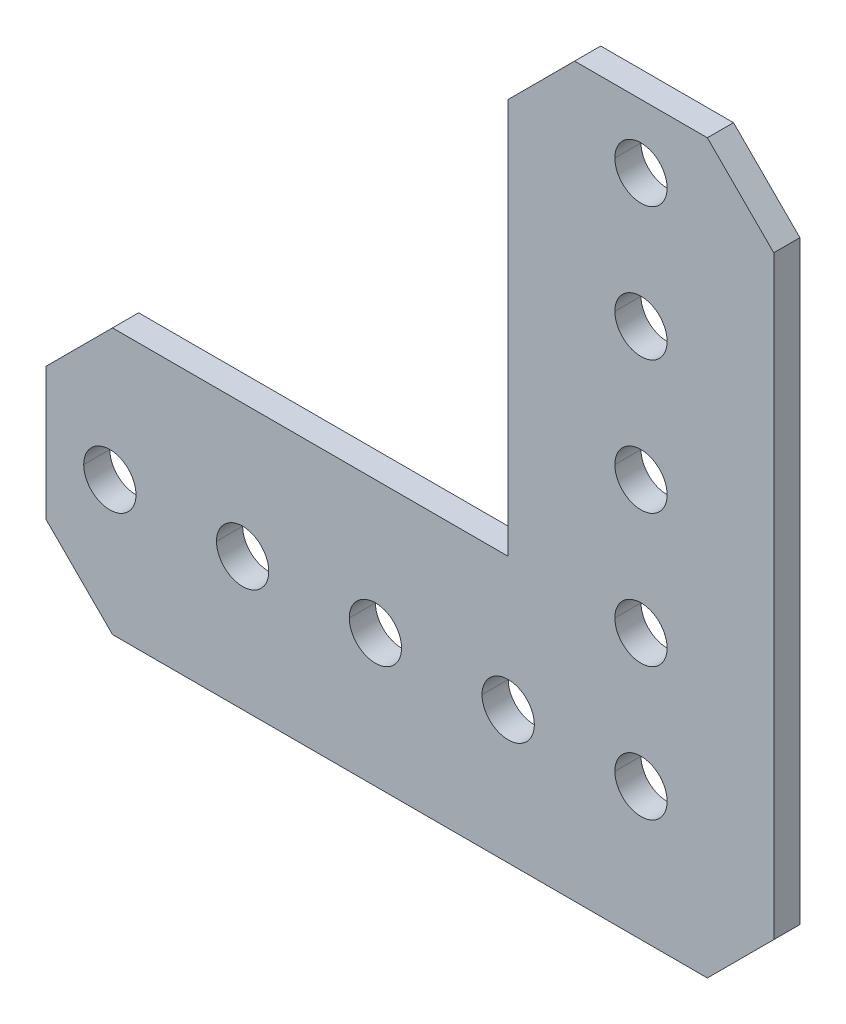
ISO-10303-21;
HEADER;
FILE_DESCRIPTION(('STEP AP214'),'2;1');
FILE_NAME('part.step','',(''),(''),'','','');
FILE_SCHEMA(('AUTOMOTIVE_DESIGN { 1 0 10303 214 1 1 1 1 }'));
ENDSEC;
DATA;
#1=APPLICATION_CONTEXT('core data for automotive mechanical design processes');
#2=APPLICATION_PROTOCOL_DEFINITION('international standard','automotive_design',2000,#1);
#3=PRODUCT_CONTEXT('',#1,'mechanical');
#4=PRODUCT('Part','Part','',(#3));
#5=PRODUCT_RELATED_PRODUCT_CATEGORY('part','',(#4));
#6=PRODUCT_DEFINITION_FORMATION('','',#4);
#7=PRODUCT_DEFINITION_CONTEXT('part definition',#1,'design');
#8=PRODUCT_DEFINITION('design','',#6,#7);
#9=PRODUCT_DEFINITION_SHAPE('','',#8);
#10=(LENGTH_UNIT() NAMED_UNIT(*) SI_UNIT(.MILLI.,.METRE.));
#11=(NAMED_UNIT(*) PLANE_ANGLE_UNIT() SI_UNIT($,.RADIAN.));
#12=(NAMED_UNIT(*) SI_UNIT($,.STERADIAN.) SOLID_ANGLE_UNIT());
#13=UNCERTAINTY_MEASURE_WITH_UNIT(LENGTH_MEASURE(1.E-05),#10,'distance_accuracy_value','');
#14=(GEOMETRIC_REPRESENTATION_CONTEXT(3) GLOBAL_UNCERTAINTY_ASSIGNED_CONTEXT((#13)) GLOBAL_UNIT_ASSIGNED_CONTEXT((#10,
#11,#12)) REPRESENTATION_CONTEXT('',''));
#15=CARTESIAN_POINT('',(0.,0.,0.));
#16=DIRECTION('',(0.,0.,1.));
#17=DIRECTION('',(1.,0.,0.));
#18=AXIS2_PLACEMENT_3D('',#15,#16,#17);
#19=CARTESIAN_POINT('',(6.34999999999982,56.896,1.25));
#20=DIRECTION('',(0.707106781186548,0.707106781186548,0.));
#21=DIRECTION('',(0.,0.,-1.));
#22=AXIS2_PLACEMENT_3D('',#19,#20,#21);
#23=PLANE('',#22);
#24=DIRECTION('',(-0.707106781186548,0.707106781186548,0.));
#25=VECTOR('',#24,1.);
#26=CARTESIAN_POINT('',(31.623,31.623,1.25));
#27=LINE('',#26,#25);
#28=CARTESIAN_POINT('',(12.6999999999998,50.546,1.25));
#29=VERTEX_POINT('',#28);
#30=CARTESIAN_POINT('',(6.34999999999981,56.896,1.25));
#31=VERTEX_POINT('',#30);
#32=EDGE_CURVE('E456',#29,#31,#27,.T.);
#33=ORIENTED_EDGE('',*,*,#32,.F.);
#34=DIRECTION('',(0.,0.,1.));
#35=VECTOR('',#34,1.);
#36=CARTESIAN_POINT('',(12.6999999999998,50.546,1.25));
#37=LINE('',#36,#35);
#38=CARTESIAN_POINT('',(12.6999999999998,50.546,-1.25));
#39=VERTEX_POINT('',#38);
#40=EDGE_CURVE('E446',#39,#29,#37,.T.);
#41=ORIENTED_EDGE('',*,*,#40,.F.);
#42=DIRECTION('',(0.707106781186548,-0.707106781186548,0.));
#43=VECTOR('',#42,1.);
#44=CARTESIAN_POINT('',(6.34999999999982,56.896,-1.25));
#45=LINE('',#44,#43);
#46=CARTESIAN_POINT('',(6.34999999999981,56.896,-1.25));
#47=VERTEX_POINT('',#46);
#48=EDGE_CURVE('E287',#47,#39,#45,.T.);
#49=ORIENTED_EDGE('',*,*,#48,.F.);
#50=DIRECTION('',(0.,0.,-1.));
#51=VECTOR('',#50,1.);
#52=CARTESIAN_POINT('',(6.34999999999981,56.896,-1.25));
#53=LINE('',#52,#51);
#54=EDGE_CURVE('E388',#31,#47,#53,.T.);
#55=ORIENTED_EDGE('',*,*,#54,.F.);
#56=EDGE_LOOP('',(#33,#41,#49,#55));
#57=FACE_BOUND('',#56,.T.);
#58=ADVANCED_FACE('F16',(#57),#23,.T.);
#59=CARTESIAN_POINT('',(-12.7000000000002,50.546,1.25));
#60=DIRECTION('',(0.707106781186548,-0.707106781186548,0.));
#61=DIRECTION('',(0.,0.,-1.));
#62=AXIS2_PLACEMENT_3D('',#59,#60,#61);
#63=PLANE('',#62);
#64=DIRECTION('',(-0.707106781186548,-0.707106781186548,0.));
#65=VECTOR('',#64,1.);
#66=CARTESIAN_POINT('',(-31.623,31.623,1.25));
#67=LINE('',#66,#65);
#68=CARTESIAN_POINT('',(-6.35000000000021,56.896,1.25));
#69=VERTEX_POINT('',#68);
#70=CARTESIAN_POINT('',(-12.7000000000002,50.546,1.25));
#71=VERTEX_POINT('',#70);
#72=EDGE_CURVE('E459',#69,#71,#67,.T.);
#73=ORIENTED_EDGE('',*,*,#72,.F.);
#74=DIRECTION('',(0.,0.,1.));
#75=VECTOR('',#74,1.);
#76=CARTESIAN_POINT('',(-6.35000000000021,56.896,1.25));
#77=LINE('',#76,#75);
#78=CARTESIAN_POINT('',(-6.35000000000021,56.896,-1.25));
#79=VERTEX_POINT('',#78);
#80=EDGE_CURVE('E389',#79,#69,#77,.T.);
#81=ORIENTED_EDGE('',*,*,#80,.F.);
#82=DIRECTION('',(0.707106781186548,0.707106781186548,0.));
#83=VECTOR('',#82,1.);
#84=CARTESIAN_POINT('',(-12.7000000000002,50.546,-1.25));
#85=LINE('',#84,#83);
#86=CARTESIAN_POINT('',(-12.7000000000002,50.546,-1.25));
#87=VERTEX_POINT('',#86);
#88=EDGE_CURVE('E425',#87,#79,#85,.T.);
#89=ORIENTED_EDGE('',*,*,#88,.F.);
#90=DIRECTION('',(0.,0.,-1.));
#91=VECTOR('',#90,1.);
#92=CARTESIAN_POINT('',(-12.7000000000002,50.546,1.25));
#93=LINE('',#92,#91);
#94=EDGE_CURVE('E524',#71,#87,#93,.T.);
#95=ORIENTED_EDGE('',*,*,#94,.F.);
#96=EDGE_LOOP('',(#73,#81,#89,#95));
#97=FACE_BOUND('',#96,.T.);
#98=ADVANCED_FACE('F18',(#97),#63,.F.);
#99=CARTESIAN_POINT('',(-56.896,6.35,1.25));
#100=DIRECTION('',(0.707106781186546,-0.707106781186549,0.));
#101=DIRECTION('',(0.,0.,-1.));
#102=AXIS2_PLACEMENT_3D('',#99,#100,#101);
#103=PLANE('',#102);
#104=DIRECTION('',(-0.707106781186549,-0.707106781186546,0.));
#105=VECTOR('',#104,1.);
#106=CARTESIAN_POINT('',(-31.623,31.623,1.25));
#107=LINE('',#106,#105);
#108=CARTESIAN_POINT('',(-50.546,12.7,1.25));
#109=VERTEX_POINT('',#108);
#110=CARTESIAN_POINT('',(-56.896,6.35,1.25));
#111=VERTEX_POINT('',#110);
#112=EDGE_CURVE('E38',#109,#111,#107,.T.);
#113=ORIENTED_EDGE('',*,*,#112,.F.);
#114=DIRECTION('',(0.,0.,1.));
#115=VECTOR('',#114,1.);
#116=CARTESIAN_POINT('',(-50.546,12.7,1.25));
#117=LINE('',#116,#115);
#118=CARTESIAN_POINT('',(-50.546,12.7,-1.25));
#119=VERTEX_POINT('',#118);
#120=EDGE_CURVE('E433',#119,#109,#117,.T.);
#121=ORIENTED_EDGE('',*,*,#120,.F.);
#122=DIRECTION('',(0.707106781186549,0.707106781186546,0.));
#123=VECTOR('',#122,1.);
#124=CARTESIAN_POINT('',(-56.896,6.35,-1.25));
#125=LINE('',#124,#123);
#126=CARTESIAN_POINT('',(-56.896,6.35,-1.25));
#127=VERTEX_POINT('',#126);
#128=EDGE_CURVE('E428',#127,#119,#125,.T.);
#129=ORIENTED_EDGE('',*,*,#128,.F.);
#130=DIRECTION('',(0.,0.,-1.));
#131=VECTOR('',#130,1.);
#132=CARTESIAN_POINT('',(-56.896,6.35,1.25));
#133=LINE('',#132,#131);
#134=EDGE_CURVE('E508',#111,#127,#133,.T.);
#135=ORIENTED_EDGE('',*,*,#134,.F.);
#136=EDGE_LOOP('',(#113,#121,#129,#135));
#137=FACE_BOUND('',#136,.T.);
#138=ADVANCED_FACE('F650',(#137),#103,.F.);
#139=CARTESIAN_POINT('',(-50.546,-12.7,1.25));
#140=DIRECTION('',(-0.707106781186548,-0.707106781186547,0.));
#141=DIRECTION('',(-0.707106781186547,0.707106781186548,0.));
#142=AXIS2_PLACEMENT_3D('',#139,#140,#141);
#143=PLANE('',#142);
#144=DIRECTION('',(0.707106781186547,-0.707106781186548,0.));
#145=VECTOR('',#144,1.);
#146=CARTESIAN_POINT('',(-31.623,-31.623,1.25));
#147=LINE('',#146,#145);
#148=CARTESIAN_POINT('',(-56.896,-6.35,1.25));
#149=VERTEX_POINT('',#148);
#150=CARTESIAN_POINT('',(-50.546,-12.7,1.25));
#151=VERTEX_POINT('',#150);
#152=EDGE_CURVE('E49',#149,#151,#147,.T.);
#153=ORIENTED_EDGE('',*,*,#152,.F.);
#154=DIRECTION('',(0.,0.,1.));
#155=VECTOR('',#154,1.);
#156=CARTESIAN_POINT('',(-56.896,-6.35,1.25));
#157=LINE('',#156,#155);
#158=CARTESIAN_POINT('',(-56.896,-6.35,-1.25));
#159=VERTEX_POINT('',#158);
#160=EDGE_CURVE('E569',#159,#149,#157,.T.);
#161=ORIENTED_EDGE('',*,*,#160,.F.);
#162=DIRECTION('',(-0.707106781186547,0.707106781186548,0.));
#163=VECTOR('',#162,1.);
#164=CARTESIAN_POINT('',(-50.546,-12.7,-1.25));
#165=LINE('',#164,#163);
#166=CARTESIAN_POINT('',(-50.546,-12.7,-1.25));
#167=VERTEX_POINT('',#166);
#168=EDGE_CURVE('E481',#167,#159,#165,.T.);
#169=ORIENTED_EDGE('',*,*,#168,.F.);
#170=DIRECTION('',(0.,0.,-1.));
#171=VECTOR('',#170,1.);
#172=CARTESIAN_POINT('',(-50.546,-12.7,-1.25));
#173=LINE('',#172,#171);
#174=EDGE_CURVE('E499',#151,#167,#173,.T.);
#175=ORIENTED_EDGE('',*,*,#174,.F.);
#176=EDGE_LOOP('',(#153,#161,#169,#175));
#177=FACE_BOUND('',#176,.T.);
#178=ADVANCED_FACE('F619',(#177),#143,.T.);
#179=CARTESIAN_POINT('',(0.,38.1,1.25));
#180=DIRECTION('',(0.,0.,1.));
#181=DIRECTION('',(1.,0.,0.));
#182=AXIS2_PLACEMENT_3D('',#179,#180,#181);
#183=CYLINDRICAL_SURFACE('',#182,2.5);
#184=DIRECTION('',(0.,0.,1.));
#185=VECTOR('',#184,1.);
#186=CARTESIAN_POINT('',(-2.49999999999996,38.1,1.25));
#187=LINE('',#186,#185);
#188=CARTESIAN_POINT('',(-2.49999999999996,38.1,-1.25));
#189=VERTEX_POINT('',#188);
#190=CARTESIAN_POINT('',(-2.49999999999996,38.1,1.25));
#191=VERTEX_POINT('',#190);
#192=EDGE_CURVE('E281',#189,#191,#187,.T.);
#193=ORIENTED_EDGE('',*,*,#192,.F.);
#194=CARTESIAN_POINT('',(0.,38.1,-1.25));
#195=DIRECTION('',(0.,0.,1.));
#196=DIRECTION('',(1.,0.,0.));
#197=AXIS2_PLACEMENT_3D('',#194,#195,#196);
#198=CIRCLE('',#197,2.5);
#199=CARTESIAN_POINT('',(2.50000000000004,38.1,-1.25));
#200=VERTEX_POINT('',#199);
#201=EDGE_CURVE('E275',#200,#189,#198,.T.);
#202=ORIENTED_EDGE('',*,*,#201,.F.);
#203=DIRECTION('',(0.,0.,1.));
#204=VECTOR('',#203,1.);
#205=CARTESIAN_POINT('',(2.50000000000004,38.1,1.25));
#206=LINE('',#205,#204);
#207=CARTESIAN_POINT('',(2.50000000000004,38.1,1.25));
#208=VERTEX_POINT('',#207);
#209=EDGE_CURVE('E278',#200,#208,#206,.T.);
#210=ORIENTED_EDGE('',*,*,#209,.T.);
#211=CARTESIAN_POINT('',(0.,38.1,1.25));
#212=DIRECTION('',(0.,0.,1.));
#213=DIRECTION('',(1.,0.,0.));
#214=AXIS2_PLACEMENT_3D('',#211,#212,#213);
#215=CIRCLE('',#214,2.5);
#216=EDGE_CURVE('E495',#208,#191,#215,.T.);
#217=ORIENTED_EDGE('',*,*,#216,.T.);
#218=EDGE_LOOP('',(#193,#202,#210,#217));
#219=FACE_BOUND('',#218,.T.);
#220=ADVANCED_FACE('F277',(#219),#183,.F.);
#221=CARTESIAN_POINT('',(0.,50.8,1.25));
#222=DIRECTION('',(0.,0.,1.));
#223=DIRECTION('',(1.,0.,0.));
#224=AXIS2_PLACEMENT_3D('',#221,#222,#223);
#225=CYLINDRICAL_SURFACE('',#224,2.5);
#226=DIRECTION('',(0.,0.,1.));
#227=VECTOR('',#226,1.);
#228=CARTESIAN_POINT('',(-2.5,50.8,1.25));
#229=LINE('',#228,#227);
#230=CARTESIAN_POINT('',(-2.5,50.8,-1.25));
#231=VERTEX_POINT('',#230);
#232=CARTESIAN_POINT('',(-2.5,50.8,1.25));
#233=VERTEX_POINT('',#232);
#234=EDGE_CURVE('E334',#231,#233,#229,.T.);
#235=ORIENTED_EDGE('',*,*,#234,.F.);
#236=CARTESIAN_POINT('',(0.,50.8,-1.25));
#237=DIRECTION('',(0.,0.,1.));
#238=DIRECTION('',(1.,0.,0.));
#239=AXIS2_PLACEMENT_3D('',#236,#237,#238);
#240=CIRCLE('',#239,2.5);
#241=CARTESIAN_POINT('',(2.5,50.8,-1.25));
#242=VERTEX_POINT('',#241);
#243=EDGE_CURVE('E286',#242,#231,#240,.T.);
#244=ORIENTED_EDGE('',*,*,#243,.F.);
#245=DIRECTION('',(0.,0.,1.));
#246=VECTOR('',#245,1.);
#247=CARTESIAN_POINT('',(2.5,50.8,1.25));
#248=LINE('',#247,#246);
#249=CARTESIAN_POINT('',(2.5,50.8,1.25));
#250=VERTEX_POINT('',#249);
#251=EDGE_CURVE('E349',#242,#250,#248,.T.);
#252=ORIENTED_EDGE('',*,*,#251,.T.);
#253=CARTESIAN_POINT('',(0.,50.8,1.25));
#254=DIRECTION('',(0.,0.,1.));
#255=DIRECTION('',(1.,0.,0.));
#256=AXIS2_PLACEMENT_3D('',#253,#254,#255);
#257=CIRCLE('',#256,2.5);
#258=EDGE_CURVE('E491',#250,#233,#257,.T.);
#259=ORIENTED_EDGE('',*,*,#258,.T.);
#260=EDGE_LOOP('',(#235,#244,#252,#259));
#261=FACE_BOUND('',#260,.T.);
#262=ADVANCED_FACE('F605',(#261),#225,.F.);
#263=CARTESIAN_POINT('',(-38.1,0.,1.25));
#264=DIRECTION('',(0.,0.,1.));
#265=DIRECTION('',(1.,0.,0.));
#266=AXIS2_PLACEMENT_3D('',#263,#264,#265);
#267=CYLINDRICAL_SURFACE('',#266,2.5);
#268=DIRECTION('',(0.,0.,1.));
#269=VECTOR('',#268,1.);
#270=CARTESIAN_POINT('',(-40.6,0.,1.25));
#271=LINE('',#270,#269);
#272=CARTESIAN_POINT('',(-40.6,0.,-1.25));
#273=VERTEX_POINT('',#272);
#274=CARTESIAN_POINT('',(-40.6,0.,1.25));
#275=VERTEX_POINT('',#274);
#276=EDGE_CURVE('E363',#273,#275,#271,.T.);
#277=ORIENTED_EDGE('',*,*,#276,.F.);
#278=CARTESIAN_POINT('',(-38.1,0.,-1.25));
#279=DIRECTION('',(0.,0.,1.));
#280=DIRECTION('',(1.,0.,0.));
#281=AXIS2_PLACEMENT_3D('',#278,#279,#280);
#282=CIRCLE('',#281,2.5);
#283=CARTESIAN_POINT('',(-35.6,0.,-1.25));
#284=VERTEX_POINT('',#283);
#285=EDGE_CURVE('E25',#284,#273,#282,.T.);
#286=ORIENTED_EDGE('',*,*,#285,.F.);
#287=DIRECTION('',(0.,0.,1.));
#288=VECTOR('',#287,1.);
#289=CARTESIAN_POINT('',(-35.6,0.,1.25));
#290=LINE('',#289,#288);
#291=CARTESIAN_POINT('',(-35.6,0.,1.25));
#292=VERTEX_POINT('',#291);
#293=EDGE_CURVE('E318',#284,#292,#290,.T.);
#294=ORIENTED_EDGE('',*,*,#293,.T.);
#295=CARTESIAN_POINT('',(-38.1,0.,1.25));
#296=DIRECTION('',(0.,0.,1.));
#297=DIRECTION('',(1.,0.,0.));
#298=AXIS2_PLACEMENT_3D('',#295,#296,#297);
#299=CIRCLE('',#298,2.5);
#300=EDGE_CURVE('E494',#292,#275,#299,.T.);
#301=ORIENTED_EDGE('',*,*,#300,.T.);
#302=EDGE_LOOP('',(#277,#286,#294,#301));
#303=FACE_BOUND('',#302,.T.);
#304=ADVANCED_FACE('F669',(#303),#267,.F.);
#305=CARTESIAN_POINT('',(-50.8,0.,1.25));
#306=DIRECTION('',(0.,0.,1.));
#307=DIRECTION('',(1.,0.,0.));
#308=AXIS2_PLACEMENT_3D('',#305,#306,#307);
#309=CYLINDRICAL_SURFACE('',#308,2.5);
#310=DIRECTION('',(0.,0.,1.));
#311=VECTOR('',#310,1.);
#312=CARTESIAN_POINT('',(-53.3,0.,1.25));
#313=LINE('',#312,#311);
#314=CARTESIAN_POINT('',(-53.3,0.,-1.25));
#315=VERTEX_POINT('',#314);
#316=CARTESIAN_POINT('',(-53.3,0.,1.25));
#317=VERTEX_POINT('',#316);
#318=EDGE_CURVE('E317',#315,#317,#313,.T.);
#319=ORIENTED_EDGE('',*,*,#318,.F.);
#320=CARTESIAN_POINT('',(-50.8,0.,-1.25));
#321=DIRECTION('',(0.,0.,1.));
#322=DIRECTION('',(1.,0.,0.));
#323=AXIS2_PLACEMENT_3D('',#320,#321,#322);
#324=CIRCLE('',#323,2.5);
#325=CARTESIAN_POINT('',(-48.3,0.,-1.25));
#326=VERTEX_POINT('',#325);
#327=EDGE_CURVE('E10',#326,#315,#324,.T.);
#328=ORIENTED_EDGE('',*,*,#327,.F.);
#329=DIRECTION('',(0.,0.,1.));
#330=VECTOR('',#329,1.);
#331=CARTESIAN_POINT('',(-48.3,0.,1.25));
#332=LINE('',#331,#330);
#333=CARTESIAN_POINT('',(-48.3,0.,1.25));
#334=VERTEX_POINT('',#333);
#335=EDGE_CURVE('E325',#326,#334,#332,.T.);
#336=ORIENTED_EDGE('',*,*,#335,.T.);
#337=CARTESIAN_POINT('',(-50.8,0.,1.25));
#338=DIRECTION('',(0.,0.,1.));
#339=DIRECTION('',(1.,0.,0.));
#340=AXIS2_PLACEMENT_3D('',#337,#338,#339);
#341=CIRCLE('',#340,2.5);
#342=EDGE_CURVE('E484',#334,#317,#341,.T.);
#343=ORIENTED_EDGE('',*,*,#342,.T.);
#344=EDGE_LOOP('',(#319,#328,#336,#343));
#345=FACE_BOUND('',#344,.T.);
#346=ADVANCED_FACE('F666',(#345),#309,.F.);
#347=CARTESIAN_POINT('',(0.,0.,-1.25));
#348=DIRECTION('',(0.,0.,1.));
#349=DIRECTION('',(1.,0.,0.));
#350=AXIS2_PLACEMENT_3D('',#347,#348,#349);
#351=PLANE('',#350);
#352=CARTESIAN_POINT('',(1.19131612205636E-13,12.7,-1.25));
#353=DIRECTION('',(0.,0.,1.));
#354=DIRECTION('',(1.,0.,0.));
#355=AXIS2_PLACEMENT_3D('',#352,#353,#354);
#356=CIRCLE('',#355,2.5);
#357=CARTESIAN_POINT('',(2.50000000000012,12.7,-1.25));
#358=VERTEX_POINT('',#357);
#359=CARTESIAN_POINT('',(-2.49999999999988,12.7,-1.25));
#360=VERTEX_POINT('',#359);
#361=EDGE_CURVE('E341',#358,#360,#356,.T.);
#362=ORIENTED_EDGE('',*,*,#361,.T.);
#363=CARTESIAN_POINT('',(1.19131612205636E-13,12.7,-1.25));
#364=DIRECTION('',(0.,0.,1.));
#365=DIRECTION('',(1.,0.,0.));
#366=AXIS2_PLACEMENT_3D('',#363,#364,#365);
#367=CIRCLE('',#366,2.5);
#368=EDGE_CURVE('E441',#360,#358,#367,.T.);
#369=ORIENTED_EDGE('',*,*,#368,.T.);
#370=EDGE_LOOP('',(#362,#369));
#371=FACE_BOUND('',#370,.T.);
#372=CARTESIAN_POINT('',(0.,25.4,-1.25));
#373=DIRECTION('',(0.,0.,1.));
#374=DIRECTION('',(1.,0.,0.));
#375=AXIS2_PLACEMENT_3D('',#372,#373,#374);
#376=CIRCLE('',#375,2.5);
#377=CARTESIAN_POINT('',(2.50000000000008,25.4,-1.25));
#378=VERTEX_POINT('',#377);
#379=CARTESIAN_POINT('',(-2.49999999999992,25.4,-1.25));
#380=VERTEX_POINT('',#379);
#381=EDGE_CURVE('E473',#378,#380,#376,.T.);
#382=ORIENTED_EDGE('',*,*,#381,.T.);
#383=CARTESIAN_POINT('',(0.,25.4,-1.25));
#384=DIRECTION('',(0.,0.,1.));
#385=DIRECTION('',(1.,0.,0.));
#386=AXIS2_PLACEMENT_3D('',#383,#384,#385);
#387=CIRCLE('',#386,2.5);
#388=EDGE_CURVE('E350',#380,#378,#387,.T.);
#389=ORIENTED_EDGE('',*,*,#388,.T.);
#390=EDGE_LOOP('',(#382,#389));
#391=FACE_BOUND('',#390,.T.);
#392=CARTESIAN_POINT('',(-12.7,0.,-1.25));
#393=DIRECTION('',(0.,0.,1.));
#394=DIRECTION('',(1.,0.,0.));
#395=AXIS2_PLACEMENT_3D('',#392,#393,#394);
#396=CIRCLE('',#395,2.5);
#397=CARTESIAN_POINT('',(-10.2,0.,-1.25));
#398=VERTEX_POINT('',#397);
#399=CARTESIAN_POINT('',(-15.2,0.,-1.25));
#400=VERTEX_POINT('',#399);
#401=EDGE_CURVE('E467',#398,#400,#396,.T.);
#402=ORIENTED_EDGE('',*,*,#401,.T.);
#403=CARTESIAN_POINT('',(-12.7,0.,-1.25));
#404=DIRECTION('',(0.,0.,1.));
#405=DIRECTION('',(1.,0.,0.));
#406=AXIS2_PLACEMENT_3D('',#403,#404,#405);
#407=CIRCLE('',#406,2.5);
#408=EDGE_CURVE('E311',#400,#398,#407,.T.);
#409=ORIENTED_EDGE('',*,*,#408,.T.);
#410=EDGE_LOOP('',(#402,#409));
#411=FACE_BOUND('',#410,.T.);
#412=CARTESIAN_POINT('',(-25.4,0.,-1.25));
#413=DIRECTION('',(0.,0.,1.));
#414=DIRECTION('',(1.,0.,0.));
#415=AXIS2_PLACEMENT_3D('',#412,#413,#414);
#416=CIRCLE('',#415,2.5);
#417=CARTESIAN_POINT('',(-22.9,0.,-1.25));
#418=VERTEX_POINT('',#417);
#419=CARTESIAN_POINT('',(-27.9,0.,-1.25));
#420=VERTEX_POINT('',#419);
#421=EDGE_CURVE('E466',#418,#420,#416,.T.);
#422=ORIENTED_EDGE('',*,*,#421,.T.);
#423=CARTESIAN_POINT('',(-25.4,0.,-1.25));
#424=DIRECTION('',(0.,0.,1.));
#425=DIRECTION('',(1.,0.,0.));
#426=AXIS2_PLACEMENT_3D('',#423,#424,#425);
#427=CIRCLE('',#426,2.5);
#428=EDGE_CURVE('E401',#420,#418,#427,.T.);
#429=ORIENTED_EDGE('',*,*,#428,.T.);
#430=EDGE_LOOP('',(#422,#429));
#431=FACE_BOUND('',#430,.T.);
#432=CARTESIAN_POINT('',(0.,0.,-1.25));
#433=DIRECTION('',(0.,0.,1.));
#434=DIRECTION('',(1.,0.,0.));
#435=AXIS2_PLACEMENT_3D('',#432,#433,#434);
#436=CIRCLE('',#435,2.5);
#437=CARTESIAN_POINT('',(-2.5,0.,-1.25));
#438=VERTEX_POINT('',#437);
#439=CARTESIAN_POINT('',(2.5,0.,-1.25));
#440=VERTEX_POINT('',#439);
#441=EDGE_CURVE('E393',#438,#440,#436,.T.);
#442=ORIENTED_EDGE('',*,*,#441,.T.);
#443=CARTESIAN_POINT('',(0.,0.,-1.25));
#444=DIRECTION('',(0.,0.,1.));
#445=DIRECTION('',(1.,0.,0.));
#446=AXIS2_PLACEMENT_3D('',#443,#444,#445);
#447=CIRCLE('',#446,2.5);
#448=EDGE_CURVE('E581',#440,#438,#447,.T.);
#449=ORIENTED_EDGE('',*,*,#448,.T.);
#450=EDGE_LOOP('',(#442,#449));
#451=FACE_BOUND('',#450,.T.);
#452=ORIENTED_EDGE('',*,*,#327,.T.);
#453=CARTESIAN_POINT('',(-50.8,0.,-1.25));
#454=DIRECTION('',(0.,0.,1.));
#455=DIRECTION('',(1.,0.,0.));
#456=AXIS2_PLACEMENT_3D('',#453,#454,#455);
#457=CIRCLE('',#456,2.5);
#458=EDGE_CURVE('E314',#315,#326,#457,.T.);
#459=ORIENTED_EDGE('',*,*,#458,.T.);
#460=EDGE_LOOP('',(#452,#459));
#461=FACE_BOUND('',#460,.T.);
#462=ORIENTED_EDGE('',*,*,#285,.T.);
#463=CARTESIAN_POINT('',(-38.1,0.,-1.25));
#464=DIRECTION('',(0.,0.,1.));
#465=DIRECTION('',(1.,0.,0.));
#466=AXIS2_PLACEMENT_3D('',#463,#464,#465);
#467=CIRCLE('',#466,2.5);
#468=EDGE_CURVE('E367',#273,#284,#467,.T.);
#469=ORIENTED_EDGE('',*,*,#468,.T.);
#470=EDGE_LOOP('',(#462,#469));
#471=FACE_BOUND('',#470,.T.);
#472=ORIENTED_EDGE('',*,*,#243,.T.);
#473=CARTESIAN_POINT('',(0.,50.8,-1.25));
#474=DIRECTION('',(0.,0.,1.));
#475=DIRECTION('',(1.,0.,0.));
#476=AXIS2_PLACEMENT_3D('',#473,#474,#475);
#477=CIRCLE('',#476,2.5);
#478=EDGE_CURVE('E295',#231,#242,#477,.T.);
#479=ORIENTED_EDGE('',*,*,#478,.T.);
#480=EDGE_LOOP('',(#472,#479));
#481=FACE_BOUND('',#480,.T.);
#482=ORIENTED_EDGE('',*,*,#201,.T.);
#483=CARTESIAN_POINT('',(0.,38.1,-1.25));
#484=DIRECTION('',(0.,0.,1.));
#485=DIRECTION('',(1.,0.,0.));
#486=AXIS2_PLACEMENT_3D('',#483,#484,#485);
#487=CIRCLE('',#486,2.5);
#488=EDGE_CURVE('E291',#189,#200,#487,.T.);
#489=ORIENTED_EDGE('',*,*,#488,.T.);
#490=EDGE_LOOP('',(#482,#489));
#491=FACE_BOUND('',#490,.T.);
#492=DIRECTION('',(1.,0.,0.));
#493=VECTOR('',#492,1.);
#494=CARTESIAN_POINT('',(0.,-12.7,-1.25));
#495=LINE('',#494,#493);
#496=CARTESIAN_POINT('',(6.35,-12.7,-1.25));
#497=VERTEX_POINT('',#496);
#498=EDGE_CURVE('E503',#167,#497,#495,.T.);
#499=ORIENTED_EDGE('',*,*,#498,.F.);
#500=ORIENTED_EDGE('',*,*,#168,.T.);
#501=DIRECTION('',(0.,1.,0.));
#502=VECTOR('',#501,1.);
#503=CARTESIAN_POINT('',(-56.896,0.,-1.25));
#504=LINE('',#503,#502);
#505=EDGE_CURVE('E432',#159,#127,#504,.T.);
#506=ORIENTED_EDGE('',*,*,#505,.T.);
#507=ORIENTED_EDGE('',*,*,#128,.T.);
#508=DIRECTION('',(1.,0.,0.));
#509=VECTOR('',#508,1.);
#510=CARTESIAN_POINT('',(0.,12.7,-1.25));
#511=LINE('',#510,#509);
#512=CARTESIAN_POINT('',(-12.7,12.7,-1.25));
#513=VERTEX_POINT('',#512);
#514=EDGE_CURVE('E563',#119,#513,#511,.T.);
#515=ORIENTED_EDGE('',*,*,#514,.T.);
#516=DIRECTION('',(0.,1.,0.));
#517=VECTOR('',#516,1.);
#518=CARTESIAN_POINT('',(-12.7,0.,-1.25));
#519=LINE('',#518,#517);
#520=EDGE_CURVE('E528',#513,#87,#519,.T.);
#521=ORIENTED_EDGE('',*,*,#520,.T.);
#522=ORIENTED_EDGE('',*,*,#88,.T.);
#523=DIRECTION('',(1.,0.,0.));
#524=VECTOR('',#523,1.);
#525=CARTESIAN_POINT('',(-1.55431223447522E-13,56.896,-1.25));
#526=LINE('',#525,#524);
#527=EDGE_CURVE('E543',#79,#47,#526,.T.);
#528=ORIENTED_EDGE('',*,*,#527,.T.);
#529=ORIENTED_EDGE('',*,*,#48,.T.);
#530=DIRECTION('',(0.,1.,0.));
#531=VECTOR('',#530,1.);
#532=CARTESIAN_POINT('',(12.7,0.,-1.25));
#533=LINE('',#532,#531);
#534=CARTESIAN_POINT('',(12.7,-6.35,-1.25));
#535=VERTEX_POINT('',#534);
#536=EDGE_CURVE('E442',#535,#39,#533,.T.);
#537=ORIENTED_EDGE('',*,*,#536,.F.);
#538=DIRECTION('',(0.707106781186547,0.707106781186549,0.));
#539=VECTOR('',#538,1.);
#540=CARTESIAN_POINT('',(9.525,-9.525,-1.25));
#541=LINE('',#540,#539);
#542=EDGE_CURVE('E517',#497,#535,#541,.T.);
#543=ORIENTED_EDGE('',*,*,#542,.F.);
#544=EDGE_LOOP('',(#499,#500,#506,#507,#515,#521,#522,#528,#529,#537,#543));
#545=FACE_BOUND('',#544,.T.);
#546=ADVANCED_FACE('F297',(#371,#391,#411,#431,#451,#461,#471,#481,#491,#545),#351,.F.);
#547=CARTESIAN_POINT('',(0.,0.,1.25));
#548=DIRECTION('',(0.,0.,1.));
#549=DIRECTION('',(1.,0.,0.));
#550=AXIS2_PLACEMENT_3D('',#547,#548,#549);
#551=PLANE('',#550);
#552=CARTESIAN_POINT('',(1.19131612205636E-13,12.7,1.25));
#553=DIRECTION('',(0.,0.,1.));
#554=DIRECTION('',(1.,0.,0.));
#555=AXIS2_PLACEMENT_3D('',#552,#553,#554);
#556=CIRCLE('',#555,2.5);
#557=CARTESIAN_POINT('',(2.50000000000012,12.7,1.25));
#558=VERTEX_POINT('',#557);
#559=CARTESIAN_POINT('',(-2.49999999999988,12.7,1.25));
#560=VERTEX_POINT('',#559);
#561=EDGE_CURVE('E344',#558,#560,#556,.T.);
#562=ORIENTED_EDGE('',*,*,#561,.F.);
#563=CARTESIAN_POINT('',(1.19131612205636E-13,12.7,1.25));
#564=DIRECTION('',(0.,0.,1.));
#565=DIRECTION('',(1.,0.,0.));
#566=AXIS2_PLACEMENT_3D('',#563,#564,#565);
#567=CIRCLE('',#566,2.5);
#568=EDGE_CURVE('E455',#560,#558,#567,.T.);
#569=ORIENTED_EDGE('',*,*,#568,.F.);
#570=EDGE_LOOP('',(#562,#569));
#571=FACE_BOUND('',#570,.T.);
#572=CARTESIAN_POINT('',(0.,25.4,1.25));
#573=DIRECTION('',(0.,0.,1.));
#574=DIRECTION('',(1.,0.,0.));
#575=AXIS2_PLACEMENT_3D('',#572,#573,#574);
#576=CIRCLE('',#575,2.5);
#577=CARTESIAN_POINT('',(2.50000000000008,25.4,1.25));
#578=VERTEX_POINT('',#577);
#579=CARTESIAN_POINT('',(-2.49999999999992,25.4,1.25));
#580=VERTEX_POINT('',#579);
#581=EDGE_CURVE('E476',#578,#580,#576,.T.);
#582=ORIENTED_EDGE('',*,*,#581,.F.);
#583=CARTESIAN_POINT('',(0.,25.4,1.25));
#584=DIRECTION('',(0.,0.,1.));
#585=DIRECTION('',(1.,0.,0.));
#586=AXIS2_PLACEMENT_3D('',#583,#584,#585);
#587=CIRCLE('',#586,2.5);
#588=EDGE_CURVE('E424',#580,#578,#587,.T.);
#589=ORIENTED_EDGE('',*,*,#588,.F.);
#590=EDGE_LOOP('',(#582,#589));
#591=FACE_BOUND('',#590,.T.);
#592=CARTESIAN_POINT('',(-12.7,0.,1.25));
#593=DIRECTION('',(0.,0.,1.));
#594=DIRECTION('',(1.,0.,0.));
#595=AXIS2_PLACEMENT_3D('',#592,#593,#594);
#596=CIRCLE('',#595,2.5);
#597=CARTESIAN_POINT('',(-10.2,0.,1.25));
#598=VERTEX_POINT('',#597);
#599=CARTESIAN_POINT('',(-15.2,0.,1.25));
#600=VERTEX_POINT('',#599);
#601=EDGE_CURVE('E463',#598,#600,#596,.T.);
#602=ORIENTED_EDGE('',*,*,#601,.F.);
#603=CARTESIAN_POINT('',(-12.7,0.,1.25));
#604=DIRECTION('',(0.,0.,1.));
#605=DIRECTION('',(1.,0.,0.));
#606=AXIS2_PLACEMENT_3D('',#603,#604,#605);
#607=CIRCLE('',#606,2.5);
#608=EDGE_CURVE('E310',#600,#598,#607,.T.);
#609=ORIENTED_EDGE('',*,*,#608,.F.);
#610=EDGE_LOOP('',(#602,#609));
#611=FACE_BOUND('',#610,.T.);
#612=CARTESIAN_POINT('',(-25.4,0.,1.25));
#613=DIRECTION('',(0.,0.,1.));
#614=DIRECTION('',(1.,0.,0.));
#615=AXIS2_PLACEMENT_3D('',#612,#613,#614);
#616=CIRCLE('',#615,2.5);
#617=CARTESIAN_POINT('',(-22.9,0.,1.25));
#618=VERTEX_POINT('',#617);
#619=CARTESIAN_POINT('',(-27.9,0.,1.25));
#620=VERTEX_POINT('',#619);
#621=EDGE_CURVE('E487',#618,#620,#616,.T.);
#622=ORIENTED_EDGE('',*,*,#621,.F.);
#623=CARTESIAN_POINT('',(-25.4,0.,1.25));
#624=DIRECTION('',(0.,0.,1.));
#625=DIRECTION('',(1.,0.,0.));
#626=AXIS2_PLACEMENT_3D('',#623,#624,#625);
#627=CIRCLE('',#626,2.5);
#628=EDGE_CURVE('E324',#620,#618,#627,.T.);
#629=ORIENTED_EDGE('',*,*,#628,.F.);
#630=EDGE_LOOP('',(#622,#629));
#631=FACE_BOUND('',#630,.T.);
#632=CARTESIAN_POINT('',(0.,0.,1.25));
#633=DIRECTION('',(0.,0.,1.));
#634=DIRECTION('',(1.,0.,0.));
#635=AXIS2_PLACEMENT_3D('',#632,#633,#634);
#636=CIRCLE('',#635,2.5);
#637=CARTESIAN_POINT('',(-2.5,0.,1.25));
#638=VERTEX_POINT('',#637);
#639=CARTESIAN_POINT('',(2.5,0.,1.25));
#640=VERTEX_POINT('',#639);
#641=EDGE_CURVE('E329',#638,#640,#636,.T.);
#642=ORIENTED_EDGE('',*,*,#641,.F.);
#643=CARTESIAN_POINT('',(0.,0.,1.25));
#644=DIRECTION('',(0.,0.,1.));
#645=DIRECTION('',(1.,0.,0.));
#646=AXIS2_PLACEMENT_3D('',#643,#644,#645);
#647=CIRCLE('',#646,2.5);
#648=EDGE_CURVE('E512',#640,#638,#647,.T.);
#649=ORIENTED_EDGE('',*,*,#648,.F.);
#650=EDGE_LOOP('',(#642,#649));
#651=FACE_BOUND('',#650,.T.);
#652=ORIENTED_EDGE('',*,*,#342,.F.);
#653=CARTESIAN_POINT('',(-50.8,0.,1.25));
#654=DIRECTION('',(0.,0.,1.));
#655=DIRECTION('',(1.,0.,0.));
#656=AXIS2_PLACEMENT_3D('',#653,#654,#655);
#657=CIRCLE('',#656,2.5);
#658=EDGE_CURVE('E330',#317,#334,#657,.T.);
#659=ORIENTED_EDGE('',*,*,#658,.F.);
#660=EDGE_LOOP('',(#652,#659));
#661=FACE_BOUND('',#660,.T.);
#662=ORIENTED_EDGE('',*,*,#300,.F.);
#663=CARTESIAN_POINT('',(-38.1,0.,1.25));
#664=DIRECTION('',(0.,0.,1.));
#665=DIRECTION('',(1.,0.,0.));
#666=AXIS2_PLACEMENT_3D('',#663,#664,#665);
#667=CIRCLE('',#666,2.5);
#668=EDGE_CURVE('E359',#275,#292,#667,.T.);
#669=ORIENTED_EDGE('',*,*,#668,.F.);
#670=EDGE_LOOP('',(#662,#669));
#671=FACE_BOUND('',#670,.T.);
#672=ORIENTED_EDGE('',*,*,#258,.F.);
#673=CARTESIAN_POINT('',(0.,50.8,1.25));
#674=DIRECTION('',(0.,0.,1.));
#675=DIRECTION('',(1.,0.,0.));
#676=AXIS2_PLACEMENT_3D('',#673,#674,#675);
#677=CIRCLE('',#676,2.5);
#678=EDGE_CURVE('E340',#233,#250,#677,.T.);
#679=ORIENTED_EDGE('',*,*,#678,.F.);
#680=EDGE_LOOP('',(#672,#679));
#681=FACE_BOUND('',#680,.T.);
#682=ORIENTED_EDGE('',*,*,#216,.F.);
#683=CARTESIAN_POINT('',(0.,38.1,1.25));
#684=DIRECTION('',(0.,0.,1.));
#685=DIRECTION('',(1.,0.,0.));
#686=AXIS2_PLACEMENT_3D('',#683,#684,#685);
#687=CIRCLE('',#686,2.5);
#688=EDGE_CURVE('E293',#191,#208,#687,.T.);
#689=ORIENTED_EDGE('',*,*,#688,.F.);
#690=EDGE_LOOP('',(#682,#689));
#691=FACE_BOUND('',#690,.T.);
#692=DIRECTION('',(0.,1.,0.));
#693=VECTOR('',#692,1.);
#694=CARTESIAN_POINT('',(-56.896,0.,1.25));
#695=LINE('',#694,#693);
#696=EDGE_CURVE('E513',#149,#111,#695,.T.);
#697=ORIENTED_EDGE('',*,*,#696,.F.);
#698=ORIENTED_EDGE('',*,*,#152,.T.);
#699=DIRECTION('',(1.,0.,0.));
#700=VECTOR('',#699,1.);
#701=CARTESIAN_POINT('',(0.,-12.7,1.25));
#702=LINE('',#701,#700);
#703=CARTESIAN_POINT('',(6.35,-12.7,1.25));
#704=VERTEX_POINT('',#703);
#705=EDGE_CURVE('E490',#151,#704,#702,.T.);
#706=ORIENTED_EDGE('',*,*,#705,.T.);
#707=DIRECTION('',(0.707106781186547,0.707106781186549,0.));
#708=VECTOR('',#707,1.);
#709=CARTESIAN_POINT('',(9.525,-9.525,1.25));
#710=LINE('',#709,#708);
#711=CARTESIAN_POINT('',(12.7,-6.35,1.25));
#712=VERTEX_POINT('',#711);
#713=EDGE_CURVE('E447',#704,#712,#710,.T.);
#714=ORIENTED_EDGE('',*,*,#713,.T.);
#715=DIRECTION('',(0.,1.,0.));
#716=VECTOR('',#715,1.);
#717=CARTESIAN_POINT('',(12.7,0.,1.25));
#718=LINE('',#717,#716);
#719=EDGE_CURVE('E539',#712,#29,#718,.T.);
#720=ORIENTED_EDGE('',*,*,#719,.T.);
#721=ORIENTED_EDGE('',*,*,#32,.T.);
#722=DIRECTION('',(1.,0.,0.));
#723=VECTOR('',#722,1.);
#724=CARTESIAN_POINT('',(-1.55431223447522E-13,56.896,1.25));
#725=LINE('',#724,#723);
#726=EDGE_CURVE('E384',#69,#31,#725,.T.);
#727=ORIENTED_EDGE('',*,*,#726,.F.);
#728=ORIENTED_EDGE('',*,*,#72,.T.);
#729=DIRECTION('',(0.,1.,0.));
#730=VECTOR('',#729,1.);
#731=CARTESIAN_POINT('',(-12.7,0.,1.25));
#732=LINE('',#731,#730);
#733=CARTESIAN_POINT('',(-12.7,12.7,1.25));
#734=VERTEX_POINT('',#733);
#735=EDGE_CURVE('E529',#734,#71,#732,.T.);
#736=ORIENTED_EDGE('',*,*,#735,.F.);
#737=DIRECTION('',(1.,0.,0.));
#738=VECTOR('',#737,1.);
#739=CARTESIAN_POINT('',(0.,12.7,1.25));
#740=LINE('',#739,#738);
#741=EDGE_CURVE('E429',#109,#734,#740,.T.);
#742=ORIENTED_EDGE('',*,*,#741,.F.);
#743=ORIENTED_EDGE('',*,*,#112,.T.);
#744=EDGE_LOOP('',(#697,#698,#706,#714,#720,#721,#727,#728,#736,#742,#743));
#745=FACE_BOUND('',#744,.T.);
#746=ADVANCED_FACE('F610',(#571,#591,#611,#631,#651,#661,#671,#681,#691,#745),#551,.T.);
#747=CARTESIAN_POINT('',(0.,0.,1.25));
#748=DIRECTION('',(0.,0.,-1.));
#749=DIRECTION('',(-1.,0.,0.));
#750=AXIS2_PLACEMENT_3D('',#747,#748,#749);
#751=CYLINDRICAL_SURFACE('',#750,2.5);
#752=DIRECTION('',(0.,0.,-1.));
#753=VECTOR('',#752,1.);
#754=CARTESIAN_POINT('',(2.5,0.,1.25));
#755=LINE('',#754,#753);
#756=EDGE_CURVE('E383',#640,#440,#755,.T.);
#757=ORIENTED_EDGE('',*,*,#756,.F.);
#758=ORIENTED_EDGE('',*,*,#648,.T.);
#759=DIRECTION('',(0.,0.,-1.));
#760=VECTOR('',#759,1.);
#761=CARTESIAN_POINT('',(-2.5,0.,1.25));
#762=LINE('',#761,#760);
#763=EDGE_CURVE('E397',#638,#438,#762,.T.);
#764=ORIENTED_EDGE('',*,*,#763,.T.);
#765=ORIENTED_EDGE('',*,*,#448,.F.);
#766=EDGE_LOOP('',(#757,#758,#764,#765));
#767=FACE_BOUND('',#766,.T.);
#768=ADVANCED_FACE('F613',(#767),#751,.F.);
#769=CARTESIAN_POINT('',(-56.896,0.,1.25));
#770=DIRECTION('',(-1.,0.,0.));
#771=DIRECTION('',(0.,0.,1.));
#772=AXIS2_PLACEMENT_3D('',#769,#770,#771);
#773=PLANE('',#772);
#774=ORIENTED_EDGE('',*,*,#505,.F.);
#775=ORIENTED_EDGE('',*,*,#160,.T.);
#776=ORIENTED_EDGE('',*,*,#696,.T.);
#777=ORIENTED_EDGE('',*,*,#134,.T.);
#778=EDGE_LOOP('',(#774,#775,#776,#777));
#779=FACE_BOUND('',#778,.T.);
#780=ADVANCED_FACE('F618',(#779),#773,.T.);
#781=CARTESIAN_POINT('',(0.,12.7,1.25));
#782=DIRECTION('',(0.,1.,0.));
#783=DIRECTION('',(1.,0.,0.));
#784=AXIS2_PLACEMENT_3D('',#781,#782,#783);
#785=PLANE('',#784);
#786=ORIENTED_EDGE('',*,*,#514,.F.);
#787=ORIENTED_EDGE('',*,*,#120,.T.);
#788=ORIENTED_EDGE('',*,*,#741,.T.);
#789=DIRECTION('',(0.,0.,-1.));
#790=VECTOR('',#789,1.);
#791=CARTESIAN_POINT('',(-12.7,12.7,1.25));
#792=LINE('',#791,#790);
#793=EDGE_CURVE('E559',#734,#513,#792,.T.);
#794=ORIENTED_EDGE('',*,*,#793,.T.);
#795=EDGE_LOOP('',(#786,#787,#788,#794));
#796=FACE_BOUND('',#795,.T.);
#797=ADVANCED_FACE('F648',(#796),#785,.T.);
#798=CARTESIAN_POINT('',(-12.7,0.,1.25));
#799=DIRECTION('',(-1.,0.,0.));
#800=DIRECTION('',(0.,1.,0.));
#801=AXIS2_PLACEMENT_3D('',#798,#799,#800);
#802=PLANE('',#801);
#803=ORIENTED_EDGE('',*,*,#735,.T.);
#804=ORIENTED_EDGE('',*,*,#94,.T.);
#805=ORIENTED_EDGE('',*,*,#520,.F.);
#806=ORIENTED_EDGE('',*,*,#793,.F.);
#807=EDGE_LOOP('',(#803,#804,#805,#806));
#808=FACE_BOUND('',#807,.T.);
#809=ADVANCED_FACE('F644',(#808),#802,.T.);
#810=CARTESIAN_POINT('',(-1.55431223447522E-13,56.896,1.25));
#811=DIRECTION('',(0.,1.,0.));
#812=DIRECTION('',(1.,0.,0.));
#813=AXIS2_PLACEMENT_3D('',#810,#811,#812);
#814=PLANE('',#813);
#815=ORIENTED_EDGE('',*,*,#527,.F.);
#816=ORIENTED_EDGE('',*,*,#80,.T.);
#817=ORIENTED_EDGE('',*,*,#726,.T.);
#818=ORIENTED_EDGE('',*,*,#54,.T.);
#819=EDGE_LOOP('',(#815,#816,#817,#818));
#820=FACE_BOUND('',#819,.T.);
#821=ADVANCED_FACE('F639',(#820),#814,.T.);
#822=CARTESIAN_POINT('',(12.7,0.,1.25));
#823=DIRECTION('',(-1.,0.,0.));
#824=DIRECTION('',(0.,1.,0.));
#825=AXIS2_PLACEMENT_3D('',#822,#823,#824);
#826=PLANE('',#825);
#827=ORIENTED_EDGE('',*,*,#536,.T.);
#828=ORIENTED_EDGE('',*,*,#40,.T.);
#829=ORIENTED_EDGE('',*,*,#719,.F.);
#830=DIRECTION('',(0.,0.,-1.));
#831=VECTOR('',#830,1.);
#832=CARTESIAN_POINT('',(12.7,-6.35,1.25));
#833=LINE('',#832,#831);
#834=EDGE_CURVE('E521',#712,#535,#833,.T.);
#835=ORIENTED_EDGE('',*,*,#834,.T.);
#836=EDGE_LOOP('',(#827,#828,#829,#835));
#837=FACE_BOUND('',#836,.T.);
#838=ADVANCED_FACE('F629',(#837),#826,.F.);
#839=CARTESIAN_POINT('',(9.525,-9.525,1.25));
#840=DIRECTION('',(-0.707106781186549,0.707106781186546,0.));
#841=DIRECTION('',(0.,0.,1.));
#842=AXIS2_PLACEMENT_3D('',#839,#840,#841);
#843=PLANE('',#842);
#844=ORIENTED_EDGE('',*,*,#542,.T.);
#845=ORIENTED_EDGE('',*,*,#834,.F.);
#846=ORIENTED_EDGE('',*,*,#713,.F.);
#847=DIRECTION('',(0.,0.,-1.));
#848=VECTOR('',#847,1.);
#849=CARTESIAN_POINT('',(6.35,-12.7,1.25));
#850=LINE('',#849,#848);
#851=EDGE_CURVE('E507',#704,#497,#850,.T.);
#852=ORIENTED_EDGE('',*,*,#851,.T.);
#853=EDGE_LOOP('',(#844,#845,#846,#852));
#854=FACE_BOUND('',#853,.T.);
#855=ADVANCED_FACE('F627',(#854),#843,.F.);
#856=CARTESIAN_POINT('',(0.,-12.7,1.25));
#857=DIRECTION('',(0.,1.,0.));
#858=DIRECTION('',(1.,0.,0.));
#859=AXIS2_PLACEMENT_3D('',#856,#857,#858);
#860=PLANE('',#859);
#861=ORIENTED_EDGE('',*,*,#705,.F.);
#862=ORIENTED_EDGE('',*,*,#174,.T.);
#863=ORIENTED_EDGE('',*,*,#498,.T.);
#864=ORIENTED_EDGE('',*,*,#851,.F.);
#865=EDGE_LOOP('',(#861,#862,#863,#864));
#866=FACE_BOUND('',#865,.T.);
#867=ADVANCED_FACE('F624',(#866),#860,.F.);
#868=CARTESIAN_POINT('',(-25.4,0.,1.25));
#869=DIRECTION('',(0.,0.,1.));
#870=DIRECTION('',(1.,0.,0.));
#871=AXIS2_PLACEMENT_3D('',#868,#869,#870);
#872=CYLINDRICAL_SURFACE('',#871,2.5);
#873=DIRECTION('',(0.,0.,1.));
#874=VECTOR('',#873,1.);
#875=CARTESIAN_POINT('',(-27.9,0.,1.25));
#876=LINE('',#875,#874);
#877=EDGE_CURVE('E405',#420,#620,#876,.T.);
#878=ORIENTED_EDGE('',*,*,#877,.F.);
#879=ORIENTED_EDGE('',*,*,#421,.F.);
#880=DIRECTION('',(0.,0.,1.));
#881=VECTOR('',#880,1.);
#882=CARTESIAN_POINT('',(-22.9,0.,1.25));
#883=LINE('',#882,#881);
#884=EDGE_CURVE('E320',#418,#618,#883,.T.);
#885=ORIENTED_EDGE('',*,*,#884,.T.);
#886=ORIENTED_EDGE('',*,*,#621,.T.);
#887=EDGE_LOOP('',(#878,#879,#885,#886));
#888=FACE_BOUND('',#887,.T.);
#889=ADVANCED_FACE('F696',(#888),#872,.F.);
#890=CARTESIAN_POINT('',(-12.7,0.,1.25));
#891=DIRECTION('',(0.,0.,1.));
#892=DIRECTION('',(1.,0.,0.));
#893=AXIS2_PLACEMENT_3D('',#890,#891,#892);
#894=CYLINDRICAL_SURFACE('',#893,2.5);
#895=DIRECTION('',(0.,0.,1.));
#896=VECTOR('',#895,1.);
#897=CARTESIAN_POINT('',(-15.2,0.,1.25));
#898=LINE('',#897,#896);
#899=EDGE_CURVE('E306',#400,#600,#898,.T.);
#900=ORIENTED_EDGE('',*,*,#899,.F.);
#901=ORIENTED_EDGE('',*,*,#401,.F.);
#902=DIRECTION('',(0.,0.,1.));
#903=VECTOR('',#902,1.);
#904=CARTESIAN_POINT('',(-10.2,0.,1.25));
#905=LINE('',#904,#903);
#906=EDGE_CURVE('E355',#398,#598,#905,.T.);
#907=ORIENTED_EDGE('',*,*,#906,.T.);
#908=ORIENTED_EDGE('',*,*,#601,.T.);
#909=EDGE_LOOP('',(#900,#901,#907,#908));
#910=FACE_BOUND('',#909,.T.);
#911=ADVANCED_FACE('F693',(#910),#894,.F.);
#912=CARTESIAN_POINT('',(0.,25.4,1.25));
#913=DIRECTION('',(0.,0.,1.));
#914=DIRECTION('',(1.,0.,0.));
#915=AXIS2_PLACEMENT_3D('',#912,#913,#914);
#916=CYLINDRICAL_SURFACE('',#915,2.5);
#917=DIRECTION('',(0.,0.,1.));
#918=VECTOR('',#917,1.);
#919=CARTESIAN_POINT('',(-2.49999999999992,25.4,1.25));
#920=LINE('',#919,#918);
#921=EDGE_CURVE('E354',#380,#580,#920,.T.);
#922=ORIENTED_EDGE('',*,*,#921,.F.);
#923=ORIENTED_EDGE('',*,*,#381,.F.);
#924=DIRECTION('',(0.,0.,1.));
#925=VECTOR('',#924,1.);
#926=CARTESIAN_POINT('',(2.50000000000008,25.4,1.25));
#927=LINE('',#926,#925);
#928=EDGE_CURVE('E437',#378,#578,#927,.T.);
#929=ORIENTED_EDGE('',*,*,#928,.T.);
#930=ORIENTED_EDGE('',*,*,#581,.T.);
#931=EDGE_LOOP('',(#922,#923,#929,#930));
#932=FACE_BOUND('',#931,.T.);
#933=ADVANCED_FACE('F691',(#932),#916,.F.);
#934=CARTESIAN_POINT('',(1.19131612205636E-13,12.7,1.25));
#935=DIRECTION('',(0.,0.,1.));
#936=DIRECTION('',(1.,0.,0.));
#937=AXIS2_PLACEMENT_3D('',#934,#935,#936);
#938=CYLINDRICAL_SURFACE('',#937,2.5);
#939=DIRECTION('',(0.,0.,1.));
#940=VECTOR('',#939,1.);
#941=CARTESIAN_POINT('',(-2.49999999999988,12.7,1.25));
#942=LINE('',#941,#940);
#943=EDGE_CURVE('E451',#360,#560,#942,.T.);
#944=ORIENTED_EDGE('',*,*,#943,.F.);
#945=ORIENTED_EDGE('',*,*,#361,.F.);
#946=DIRECTION('',(0.,0.,1.));
#947=VECTOR('',#946,1.);
#948=CARTESIAN_POINT('',(2.50000000000012,12.7,1.25));
#949=LINE('',#948,#947);
#950=EDGE_CURVE('E345',#358,#558,#949,.T.);
#951=ORIENTED_EDGE('',*,*,#950,.T.);
#952=ORIENTED_EDGE('',*,*,#561,.T.);
#953=EDGE_LOOP('',(#944,#945,#951,#952));
#954=FACE_BOUND('',#953,.T.);
#955=ADVANCED_FACE('F687',(#954),#938,.F.);
#956=CARTESIAN_POINT('',(1.19131612205636E-13,12.7,1.25));
#957=DIRECTION('',(0.,0.,1.));
#958=DIRECTION('',(1.,0.,0.));
#959=AXIS2_PLACEMENT_3D('',#956,#957,#958);
#960=CYLINDRICAL_SURFACE('',#959,2.5);
#961=ORIENTED_EDGE('',*,*,#368,.F.);
#962=ORIENTED_EDGE('',*,*,#943,.T.);
#963=ORIENTED_EDGE('',*,*,#568,.T.);
#964=ORIENTED_EDGE('',*,*,#950,.F.);
#965=EDGE_LOOP('',(#961,#962,#963,#964));
#966=FACE_BOUND('',#965,.T.);
#967=ADVANCED_FACE('F690',(#966),#960,.F.);
#968=CARTESIAN_POINT('',(0.,25.4,1.25));
#969=DIRECTION('',(0.,0.,1.));
#970=DIRECTION('',(1.,0.,0.));
#971=AXIS2_PLACEMENT_3D('',#968,#969,#970);
#972=CYLINDRICAL_SURFACE('',#971,2.5);
#973=ORIENTED_EDGE('',*,*,#388,.F.);
#974=ORIENTED_EDGE('',*,*,#921,.T.);
#975=ORIENTED_EDGE('',*,*,#588,.T.);
#976=ORIENTED_EDGE('',*,*,#928,.F.);
#977=EDGE_LOOP('',(#973,#974,#975,#976));
#978=FACE_BOUND('',#977,.T.);
#979=ADVANCED_FACE('F685',(#978),#972,.F.);
#980=CARTESIAN_POINT('',(-12.7,0.,1.25));
#981=DIRECTION('',(0.,0.,1.));
#982=DIRECTION('',(1.,0.,0.));
#983=AXIS2_PLACEMENT_3D('',#980,#981,#982);
#984=CYLINDRICAL_SURFACE('',#983,2.5);
#985=ORIENTED_EDGE('',*,*,#408,.F.);
#986=ORIENTED_EDGE('',*,*,#899,.T.);
#987=ORIENTED_EDGE('',*,*,#608,.T.);
#988=ORIENTED_EDGE('',*,*,#906,.F.);
#989=EDGE_LOOP('',(#985,#986,#987,#988));
#990=FACE_BOUND('',#989,.T.);
#991=ADVANCED_FACE('F769',(#990),#984,.F.);
#992=CARTESIAN_POINT('',(-25.4,0.,1.25));
#993=DIRECTION('',(0.,0.,1.));
#994=DIRECTION('',(1.,0.,0.));
#995=AXIS2_PLACEMENT_3D('',#992,#993,#994);
#996=CYLINDRICAL_SURFACE('',#995,2.5);
#997=ORIENTED_EDGE('',*,*,#428,.F.);
#998=ORIENTED_EDGE('',*,*,#877,.T.);
#999=ORIENTED_EDGE('',*,*,#628,.T.);
#1000=ORIENTED_EDGE('',*,*,#884,.F.);
#1001=EDGE_LOOP('',(#997,#998,#999,#1000));
#1002=FACE_BOUND('',#1001,.T.);
#1003=ADVANCED_FACE('F757',(#1002),#996,.F.);
#1004=CARTESIAN_POINT('',(0.,0.,1.25));
#1005=DIRECTION('',(0.,0.,-1.));
#1006=DIRECTION('',(-1.,0.,0.));
#1007=AXIS2_PLACEMENT_3D('',#1004,#1005,#1006);
#1008=CYLINDRICAL_SURFACE('',#1007,2.5);
#1009=ORIENTED_EDGE('',*,*,#641,.T.);
#1010=ORIENTED_EDGE('',*,*,#756,.T.);
#1011=ORIENTED_EDGE('',*,*,#441,.F.);
#1012=ORIENTED_EDGE('',*,*,#763,.F.);
#1013=EDGE_LOOP('',(#1009,#1010,#1011,#1012));
#1014=FACE_BOUND('',#1013,.T.);
#1015=ADVANCED_FACE('F718',(#1014),#1008,.F.);
#1016=CARTESIAN_POINT('',(-50.8,0.,1.25));
#1017=DIRECTION('',(0.,0.,1.));
#1018=DIRECTION('',(1.,0.,0.));
#1019=AXIS2_PLACEMENT_3D('',#1016,#1017,#1018);
#1020=CYLINDRICAL_SURFACE('',#1019,2.5);
#1021=ORIENTED_EDGE('',*,*,#458,.F.);
#1022=ORIENTED_EDGE('',*,*,#318,.T.);
#1023=ORIENTED_EDGE('',*,*,#658,.T.);
#1024=ORIENTED_EDGE('',*,*,#335,.F.);
#1025=EDGE_LOOP('',(#1021,#1022,#1023,#1024));
#1026=FACE_BOUND('',#1025,.T.);
#1027=ADVANCED_FACE('F748',(#1026),#1020,.F.);
#1028=CARTESIAN_POINT('',(-38.1,0.,1.25));
#1029=DIRECTION('',(0.,0.,1.));
#1030=DIRECTION('',(1.,0.,0.));
#1031=AXIS2_PLACEMENT_3D('',#1028,#1029,#1030);
#1032=CYLINDRICAL_SURFACE('',#1031,2.5);
#1033=ORIENTED_EDGE('',*,*,#468,.F.);
#1034=ORIENTED_EDGE('',*,*,#276,.T.);
#1035=ORIENTED_EDGE('',*,*,#668,.T.);
#1036=ORIENTED_EDGE('',*,*,#293,.F.);
#1037=EDGE_LOOP('',(#1033,#1034,#1035,#1036));
#1038=FACE_BOUND('',#1037,.T.);
#1039=ADVANCED_FACE('F728',(#1038),#1032,.F.);
#1040=CARTESIAN_POINT('',(0.,50.8,1.25));
#1041=DIRECTION('',(0.,0.,1.));
#1042=DIRECTION('',(1.,0.,0.));
#1043=AXIS2_PLACEMENT_3D('',#1040,#1041,#1042);
#1044=CYLINDRICAL_SURFACE('',#1043,2.5);
#1045=ORIENTED_EDGE('',*,*,#478,.F.);
#1046=ORIENTED_EDGE('',*,*,#234,.T.);
#1047=ORIENTED_EDGE('',*,*,#678,.T.);
#1048=ORIENTED_EDGE('',*,*,#251,.F.);
#1049=EDGE_LOOP('',(#1045,#1046,#1047,#1048));
#1050=FACE_BOUND('',#1049,.T.);
#1051=ADVANCED_FACE('F608',(#1050),#1044,.F.);
#1052=CARTESIAN_POINT('',(0.,38.1,1.25));
#1053=DIRECTION('',(0.,0.,1.));
#1054=DIRECTION('',(1.,0.,0.));
#1055=AXIS2_PLACEMENT_3D('',#1052,#1053,#1054);
#1056=CYLINDRICAL_SURFACE('',#1055,2.5);
#1057=ORIENTED_EDGE('',*,*,#488,.F.);
#1058=ORIENTED_EDGE('',*,*,#192,.T.);
#1059=ORIENTED_EDGE('',*,*,#688,.T.);
#1060=ORIENTED_EDGE('',*,*,#209,.F.);
#1061=EDGE_LOOP('',(#1057,#1058,#1059,#1060));
#1062=FACE_BOUND('',#1061,.T.);
#1063=ADVANCED_FACE('F290',(#1062),#1056,.F.);
#1064=CLOSED_SHELL('',(#58,#98,#138,#178,#220,#262,#304,#346,#546,#746,#768,#780,#797,#809,#821,
#838,#855,#867,#889,#911,#933,#955,#967,#979,#991,#1003,#1015,#1027,#1039,#1051,#1063));
#1065=MANIFOLD_SOLID_BREP('B1',#1064);
#1066=ADVANCED_BREP_SHAPE_REPRESENTATION('',(#18,#1065),#14);
#1067=SHAPE_DEFINITION_REPRESENTATION(#9,#1066);
ENDSEC;
END-ISO-10303-21;
